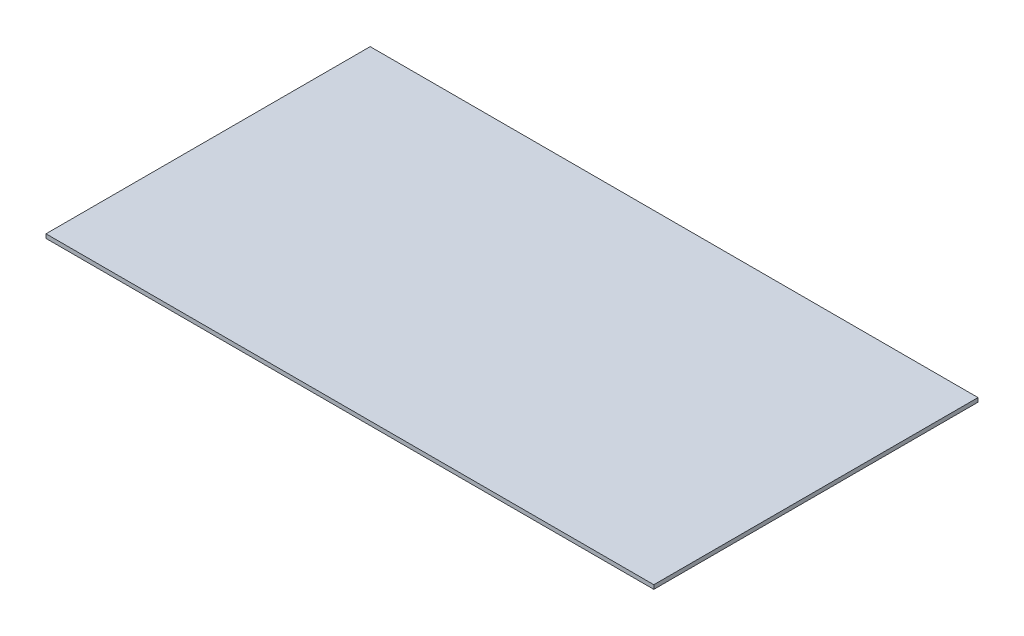
ISO-10303-21;
HEADER;
FILE_DESCRIPTION(('STEP AP214'),'2;1');
FILE_NAME('part.step','',(''),(''),'','','');
FILE_SCHEMA(('AUTOMOTIVE_DESIGN { 1 0 10303 214 1 1 1 1 }'));
ENDSEC;
DATA;
#1=APPLICATION_CONTEXT('core data for automotive mechanical design processes');
#2=APPLICATION_PROTOCOL_DEFINITION('international standard','automotive_design',2000,#1);
#3=PRODUCT_CONTEXT('',#1,'mechanical');
#4=PRODUCT('Part','Part','',(#3));
#5=PRODUCT_RELATED_PRODUCT_CATEGORY('part','',(#4));
#6=PRODUCT_DEFINITION_FORMATION('','',#4);
#7=PRODUCT_DEFINITION_CONTEXT('part definition',#1,'design');
#8=PRODUCT_DEFINITION('design','',#6,#7);
#9=PRODUCT_DEFINITION_SHAPE('','',#8);
#10=(LENGTH_UNIT() NAMED_UNIT(*) SI_UNIT(.MILLI.,.METRE.));
#11=(NAMED_UNIT(*) PLANE_ANGLE_UNIT() SI_UNIT($,.RADIAN.));
#12=(NAMED_UNIT(*) SI_UNIT($,.STERADIAN.) SOLID_ANGLE_UNIT());
#13=UNCERTAINTY_MEASURE_WITH_UNIT(LENGTH_MEASURE(1.E-05),#10,'distance_accuracy_value','');
#14=(GEOMETRIC_REPRESENTATION_CONTEXT(3) GLOBAL_UNCERTAINTY_ASSIGNED_CONTEXT((#13)) GLOBAL_UNIT_ASSIGNED_CONTEXT((#10,
#11,#12)) REPRESENTATION_CONTEXT('',''));
#15=CARTESIAN_POINT('',(0.,0.,0.));
#16=DIRECTION('',(0.,0.,1.));
#17=DIRECTION('',(1.,0.,0.));
#18=AXIS2_PLACEMENT_3D('',#15,#16,#17);
#19=CARTESIAN_POINT('',(75.,1.,40.));
#20=DIRECTION('',(-1.,0.,0.));
#21=DIRECTION('',(0.,0.,1.));
#22=AXIS2_PLACEMENT_3D('',#19,#20,#21);
#23=PLANE('',#22);
#24=DIRECTION('',(0.,0.,-1.));
#25=VECTOR('',#24,1.);
#26=CARTESIAN_POINT('',(75.,0.,40.));
#27=LINE('',#26,#25);
#28=CARTESIAN_POINT('',(75.,0.,40.));
#29=VERTEX_POINT('',#28);
#30=CARTESIAN_POINT('',(75.,0.,-40.));
#31=VERTEX_POINT('',#30);
#32=EDGE_CURVE('E96',#29,#31,#27,.T.);
#33=ORIENTED_EDGE('',*,*,#32,.T.);
#34=DIRECTION('',(0.,-1.,0.));
#35=VECTOR('',#34,1.);
#36=CARTESIAN_POINT('',(75.,1.,-40.));
#37=LINE('',#36,#35);
#38=CARTESIAN_POINT('',(75.,1.,-40.));
#39=VERTEX_POINT('',#38);
#40=EDGE_CURVE('E11',#39,#31,#37,.T.);
#41=ORIENTED_EDGE('',*,*,#40,.F.);
#42=DIRECTION('',(0.,0.,-1.));
#43=VECTOR('',#42,1.);
#44=CARTESIAN_POINT('',(75.,1.,40.));
#45=LINE('',#44,#43);
#46=CARTESIAN_POINT('',(75.,1.,40.));
#47=VERTEX_POINT('',#46);
#48=EDGE_CURVE('E84',#47,#39,#45,.T.);
#49=ORIENTED_EDGE('',*,*,#48,.F.);
#50=DIRECTION('',(0.,-1.,0.));
#51=VECTOR('',#50,1.);
#52=CARTESIAN_POINT('',(75.,1.,40.));
#53=LINE('',#52,#51);
#54=EDGE_CURVE('E92',#47,#29,#53,.T.);
#55=ORIENTED_EDGE('',*,*,#54,.T.);
#56=EDGE_LOOP('',(#33,#41,#49,#55));
#57=FACE_BOUND('',#56,.T.);
#58=ADVANCED_FACE('F33',(#57),#23,.F.);
#59=CARTESIAN_POINT('',(-75.,1.,-40.));
#60=DIRECTION('',(0.,0.,1.));
#61=DIRECTION('',(1.,0.,0.));
#62=AXIS2_PLACEMENT_3D('',#59,#60,#61);
#63=PLANE('',#62);
#64=DIRECTION('',(-1.,0.,0.));
#65=VECTOR('',#64,1.);
#66=CARTESIAN_POINT('',(-75.,0.,-40.));
#67=LINE('',#66,#65);
#68=CARTESIAN_POINT('',(-75.,0.,-40.));
#69=VERTEX_POINT('',#68);
#70=EDGE_CURVE('E88',#31,#69,#67,.T.);
#71=ORIENTED_EDGE('',*,*,#70,.T.);
#72=DIRECTION('',(0.,-1.,0.));
#73=VECTOR('',#72,1.);
#74=CARTESIAN_POINT('',(-75.,1.,-40.));
#75=LINE('',#74,#73);
#76=CARTESIAN_POINT('',(-75.,1.,-40.));
#77=VERTEX_POINT('',#76);
#78=EDGE_CURVE('E41',#77,#69,#75,.T.);
#79=ORIENTED_EDGE('',*,*,#78,.F.);
#80=DIRECTION('',(-1.,0.,0.));
#81=VECTOR('',#80,1.);
#82=CARTESIAN_POINT('',(-75.,1.,-40.));
#83=LINE('',#82,#81);
#84=EDGE_CURVE('E79',#39,#77,#83,.T.);
#85=ORIENTED_EDGE('',*,*,#84,.F.);
#86=ORIENTED_EDGE('',*,*,#40,.T.);
#87=EDGE_LOOP('',(#71,#79,#85,#86));
#88=FACE_BOUND('',#87,.T.);
#89=ADVANCED_FACE('F87',(#88),#63,.F.);
#90=CARTESIAN_POINT('',(-75.,1.,40.));
#91=DIRECTION('',(1.,0.,0.));
#92=DIRECTION('',(0.,0.,-1.));
#93=AXIS2_PLACEMENT_3D('',#90,#91,#92);
#94=PLANE('',#93);
#95=DIRECTION('',(0.,0.,1.));
#96=VECTOR('',#95,1.);
#97=CARTESIAN_POINT('',(-75.,0.,40.));
#98=LINE('',#97,#96);
#99=CARTESIAN_POINT('',(-75.,0.,40.));
#100=VERTEX_POINT('',#99);
#101=EDGE_CURVE('E66',#69,#100,#98,.T.);
#102=ORIENTED_EDGE('',*,*,#101,.T.);
#103=DIRECTION('',(0.,-1.,0.));
#104=VECTOR('',#103,1.);
#105=CARTESIAN_POINT('',(-75.,1.,40.));
#106=LINE('',#105,#104);
#107=CARTESIAN_POINT('',(-75.,1.,40.));
#108=VERTEX_POINT('',#107);
#109=EDGE_CURVE('E89',#108,#100,#106,.T.);
#110=ORIENTED_EDGE('',*,*,#109,.F.);
#111=DIRECTION('',(0.,0.,1.));
#112=VECTOR('',#111,1.);
#113=CARTESIAN_POINT('',(-75.,1.,40.));
#114=LINE('',#113,#112);
#115=EDGE_CURVE('E82',#77,#108,#114,.T.);
#116=ORIENTED_EDGE('',*,*,#115,.F.);
#117=ORIENTED_EDGE('',*,*,#78,.T.);
#118=EDGE_LOOP('',(#102,#110,#116,#117));
#119=FACE_BOUND('',#118,.T.);
#120=ADVANCED_FACE('F90',(#119),#94,.F.);
#121=CARTESIAN_POINT('',(-75.,1.,40.));
#122=DIRECTION('',(0.,0.,-1.));
#123=DIRECTION('',(-1.,0.,0.));
#124=AXIS2_PLACEMENT_3D('',#121,#122,#123);
#125=PLANE('',#124);
#126=DIRECTION('',(1.,0.,0.));
#127=VECTOR('',#126,1.);
#128=CARTESIAN_POINT('',(-75.,0.,40.));
#129=LINE('',#128,#127);
#130=EDGE_CURVE('E72',#100,#29,#129,.T.);
#131=ORIENTED_EDGE('',*,*,#130,.T.);
#132=ORIENTED_EDGE('',*,*,#54,.F.);
#133=DIRECTION('',(1.,0.,0.));
#134=VECTOR('',#133,1.);
#135=CARTESIAN_POINT('',(-75.,1.,40.));
#136=LINE('',#135,#134);
#137=EDGE_CURVE('E49',#108,#47,#136,.T.);
#138=ORIENTED_EDGE('',*,*,#137,.F.);
#139=ORIENTED_EDGE('',*,*,#109,.T.);
#140=EDGE_LOOP('',(#131,#132,#138,#139));
#141=FACE_BOUND('',#140,.T.);
#142=ADVANCED_FACE('F103',(#141),#125,.F.);
#143=CARTESIAN_POINT('',(0.,1.,0.));
#144=DIRECTION('',(0.,-1.,0.));
#145=DIRECTION('',(0.,0.,-1.));
#146=AXIS2_PLACEMENT_3D('',#143,#144,#145);
#147=PLANE('',#146);
#148=ORIENTED_EDGE('',*,*,#48,.T.);
#149=ORIENTED_EDGE('',*,*,#84,.T.);
#150=ORIENTED_EDGE('',*,*,#115,.T.);
#151=ORIENTED_EDGE('',*,*,#137,.T.);
#152=EDGE_LOOP('',(#148,#149,#150,#151));
#153=FACE_BOUND('',#152,.T.);
#154=ADVANCED_FACE('F80',(#153),#147,.F.);
#155=CARTESIAN_POINT('',(0.,0.,0.));
#156=DIRECTION('',(0.,-1.,0.));
#157=DIRECTION('',(0.,0.,-1.));
#158=AXIS2_PLACEMENT_3D('',#155,#156,#157);
#159=PLANE('',#158);
#160=ORIENTED_EDGE('',*,*,#32,.F.);
#161=ORIENTED_EDGE('',*,*,#130,.F.);
#162=ORIENTED_EDGE('',*,*,#101,.F.);
#163=ORIENTED_EDGE('',*,*,#70,.F.);
#164=EDGE_LOOP('',(#160,#161,#162,#163));
#165=FACE_BOUND('',#164,.T.);
#166=ADVANCED_FACE('F106',(#165),#159,.T.);
#167=CLOSED_SHELL('',(#58,#89,#120,#142,#154,#166));
#168=MANIFOLD_SOLID_BREP('B2',#167);
#169=ADVANCED_BREP_SHAPE_REPRESENTATION('',(#18,#168),#14);
#170=SHAPE_DEFINITION_REPRESENTATION(#9,#169);
ENDSEC;
END-ISO-10303-21;
